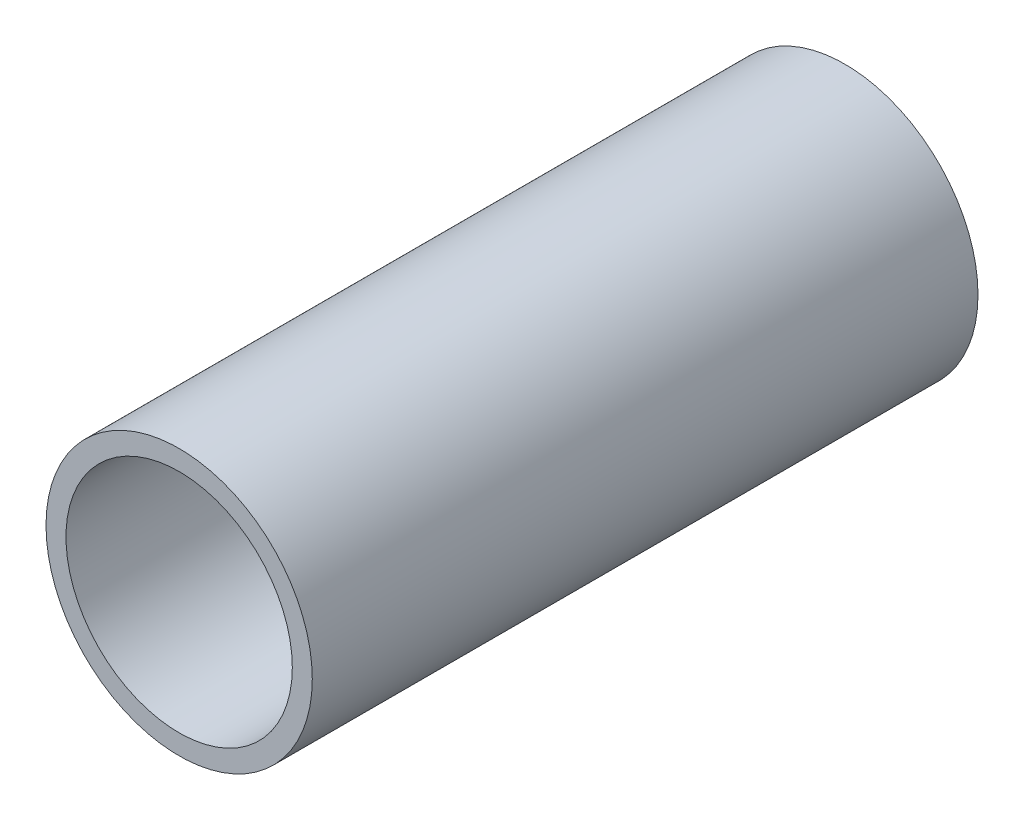
ISO-10303-21;
HEADER;
FILE_DESCRIPTION(('STEP AP214'),'2;1');
FILE_NAME('part.step','',(''),(''),'','','');
FILE_SCHEMA(('AUTOMOTIVE_DESIGN { 1 0 10303 214 1 1 1 1 }'));
ENDSEC;
DATA;
#1=APPLICATION_CONTEXT('core data for automotive mechanical design processes');
#2=APPLICATION_PROTOCOL_DEFINITION('international standard','automotive_design',2000,#1);
#3=PRODUCT_CONTEXT('',#1,'mechanical');
#4=PRODUCT('Part','Part','',(#3));
#5=PRODUCT_RELATED_PRODUCT_CATEGORY('part','',(#4));
#6=PRODUCT_DEFINITION_FORMATION('','',#4);
#7=PRODUCT_DEFINITION_CONTEXT('part definition',#1,'design');
#8=PRODUCT_DEFINITION('design','',#6,#7);
#9=PRODUCT_DEFINITION_SHAPE('','',#8);
#10=(LENGTH_UNIT() NAMED_UNIT(*) SI_UNIT(.MILLI.,.METRE.));
#11=(NAMED_UNIT(*) PLANE_ANGLE_UNIT() SI_UNIT($,.RADIAN.));
#12=(NAMED_UNIT(*) SI_UNIT($,.STERADIAN.) SOLID_ANGLE_UNIT());
#13=UNCERTAINTY_MEASURE_WITH_UNIT(LENGTH_MEASURE(1.E-05),#10,'distance_accuracy_value','');
#14=(GEOMETRIC_REPRESENTATION_CONTEXT(3) GLOBAL_UNCERTAINTY_ASSIGNED_CONTEXT((#13)) GLOBAL_UNIT_ASSIGNED_CONTEXT((#10,
#11,#12)) REPRESENTATION_CONTEXT('',''));
#15=CARTESIAN_POINT('',(0.,0.,0.));
#16=DIRECTION('',(0.,0.,1.));
#17=DIRECTION('',(1.,0.,0.));
#18=AXIS2_PLACEMENT_3D('',#15,#16,#17);
#19=CARTESIAN_POINT('',(0.,0.,-100.));
#20=DIRECTION('',(0.,0.,1.));
#21=DIRECTION('',(1.,0.,0.));
#22=AXIS2_PLACEMENT_3D('',#19,#20,#21);
#23=CYLINDRICAL_SURFACE('',#22,20.);
#24=CARTESIAN_POINT('',(0.,0.,-100.));
#25=DIRECTION('',(0.,0.,1.));
#26=DIRECTION('',(1.,0.,0.));
#27=AXIS2_PLACEMENT_3D('',#24,#25,#26);
#28=CIRCLE('',#27,20.);
#29=CARTESIAN_POINT('',(20.,0.,-100.));
#30=VERTEX_POINT('',#29);
#31=EDGE_CURVE('E10',#30,#30,#28,.T.);
#32=ORIENTED_EDGE('',*,*,#31,.T.);
#33=EDGE_LOOP('',(#32));
#34=FACE_BOUND('',#33,.T.);
#35=CARTESIAN_POINT('',(0.,0.,0.));
#36=DIRECTION('',(0.,0.,1.));
#37=DIRECTION('',(1.,0.,0.));
#38=AXIS2_PLACEMENT_3D('',#35,#36,#37);
#39=CIRCLE('',#38,20.);
#40=CARTESIAN_POINT('',(20.,0.,0.));
#41=VERTEX_POINT('',#40);
#42=EDGE_CURVE('E42',#41,#41,#39,.T.);
#43=ORIENTED_EDGE('',*,*,#42,.F.);
#44=EDGE_LOOP('',(#43));
#45=FACE_BOUND('',#44,.T.);
#46=ADVANCED_FACE('F39',(#34,#45),#23,.T.);
#47=CARTESIAN_POINT('',(0.,0.,-100.));
#48=DIRECTION('',(0.,0.,1.));
#49=DIRECTION('',(1.,0.,0.));
#50=AXIS2_PLACEMENT_3D('',#47,#48,#49);
#51=PLANE('',#50);
#52=CARTESIAN_POINT('',(0.,0.,-100.));
#53=DIRECTION('',(0.,0.,1.));
#54=DIRECTION('',(1.,0.,0.));
#55=AXIS2_PLACEMENT_3D('',#52,#53,#54);
#56=CIRCLE('',#55,17.);
#57=CARTESIAN_POINT('',(17.,0.,-100.));
#58=VERTEX_POINT('',#57);
#59=EDGE_CURVE('E52',#58,#58,#56,.T.);
#60=ORIENTED_EDGE('',*,*,#59,.T.);
#61=EDGE_LOOP('',(#60));
#62=FACE_BOUND('',#61,.T.);
#63=ORIENTED_EDGE('',*,*,#31,.F.);
#64=EDGE_LOOP('',(#63));
#65=FACE_BOUND('',#64,.T.);
#66=ADVANCED_FACE('F61',(#62,#65),#51,.F.);
#67=CARTESIAN_POINT('',(0.,0.,0.));
#68=DIRECTION('',(0.,0.,1.));
#69=DIRECTION('',(1.,0.,0.));
#70=AXIS2_PLACEMENT_3D('',#67,#68,#69);
#71=PLANE('',#70);
#72=CARTESIAN_POINT('',(0.,0.,0.));
#73=DIRECTION('',(0.,0.,1.));
#74=DIRECTION('',(1.,0.,0.));
#75=AXIS2_PLACEMENT_3D('',#72,#73,#74);
#76=CIRCLE('',#75,17.);
#77=CARTESIAN_POINT('',(17.,0.,0.));
#78=VERTEX_POINT('',#77);
#79=EDGE_CURVE('E54',#78,#78,#76,.T.);
#80=ORIENTED_EDGE('',*,*,#79,.F.);
#81=EDGE_LOOP('',(#80));
#82=FACE_BOUND('',#81,.T.);
#83=ORIENTED_EDGE('',*,*,#42,.T.);
#84=EDGE_LOOP('',(#83));
#85=FACE_BOUND('',#84,.T.);
#86=ADVANCED_FACE('F67',(#82,#85),#71,.T.);
#87=CARTESIAN_POINT('',(0.,0.,-100.));
#88=DIRECTION('',(0.,0.,1.));
#89=DIRECTION('',(1.,0.,0.));
#90=AXIS2_PLACEMENT_3D('',#87,#88,#89);
#91=CYLINDRICAL_SURFACE('',#90,17.);
#92=ORIENTED_EDGE('',*,*,#59,.F.);
#93=EDGE_LOOP('',(#92));
#94=FACE_BOUND('',#93,.T.);
#95=ORIENTED_EDGE('',*,*,#79,.T.);
#96=EDGE_LOOP('',(#95));
#97=FACE_BOUND('',#96,.T.);
#98=ADVANCED_FACE('F64',(#94,#97),#91,.F.);
#99=CLOSED_SHELL('',(#46,#66,#86,#98));
#100=MANIFOLD_SOLID_BREP('B2',#99);
#101=ADVANCED_BREP_SHAPE_REPRESENTATION('',(#18,#100),#14);
#102=SHAPE_DEFINITION_REPRESENTATION(#9,#101);
ENDSEC;
END-ISO-10303-21;
